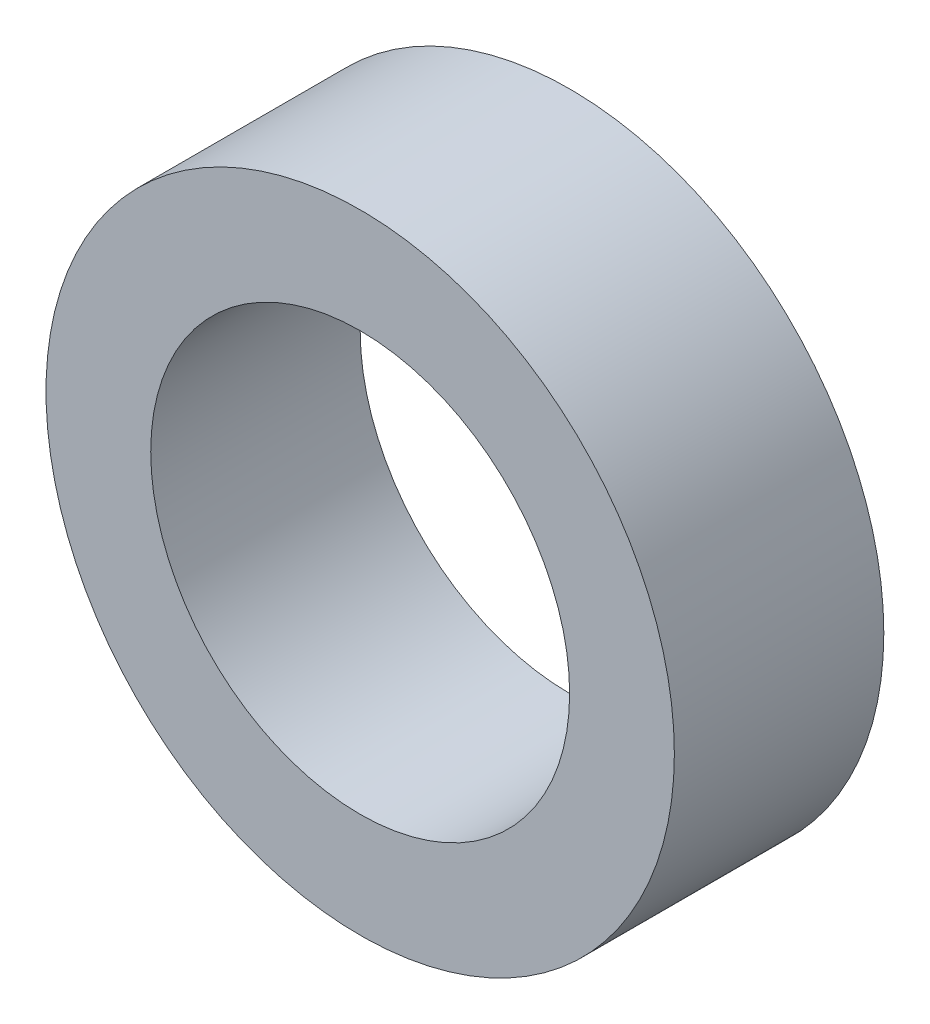
ISO-10303-21;
HEADER;
FILE_DESCRIPTION(('STEP AP214'),'2;1');
FILE_NAME('part.step','',(''),(''),'','','');
FILE_SCHEMA(('AUTOMOTIVE_DESIGN { 1 0 10303 214 1 1 1 1 }'));
ENDSEC;
DATA;
#1=APPLICATION_CONTEXT('core data for automotive mechanical design processes');
#2=APPLICATION_PROTOCOL_DEFINITION('international standard','automotive_design',2000,#1);
#3=PRODUCT_CONTEXT('',#1,'mechanical');
#4=PRODUCT('Part','Part','',(#3));
#5=PRODUCT_RELATED_PRODUCT_CATEGORY('part','',(#4));
#6=PRODUCT_DEFINITION_FORMATION('','',#4);
#7=PRODUCT_DEFINITION_CONTEXT('part definition',#1,'design');
#8=PRODUCT_DEFINITION('design','',#6,#7);
#9=PRODUCT_DEFINITION_SHAPE('','',#8);
#10=(LENGTH_UNIT() NAMED_UNIT(*) SI_UNIT(.MILLI.,.METRE.));
#11=(NAMED_UNIT(*) PLANE_ANGLE_UNIT() SI_UNIT($,.RADIAN.));
#12=(NAMED_UNIT(*) SI_UNIT($,.STERADIAN.) SOLID_ANGLE_UNIT());
#13=UNCERTAINTY_MEASURE_WITH_UNIT(LENGTH_MEASURE(1.E-05),#10,'distance_accuracy_value','');
#14=(GEOMETRIC_REPRESENTATION_CONTEXT(3) GLOBAL_UNCERTAINTY_ASSIGNED_CONTEXT((#13)) GLOBAL_UNIT_ASSIGNED_CONTEXT((#10,
#11,#12)) REPRESENTATION_CONTEXT('',''));
#15=CARTESIAN_POINT('',(0.,0.,0.));
#16=DIRECTION('',(0.,0.,1.));
#17=DIRECTION('',(1.,0.,0.));
#18=AXIS2_PLACEMENT_3D('',#15,#16,#17);
#19=CARTESIAN_POINT('',(0.,0.,4.));
#20=DIRECTION('',(0.,0.,1.));
#21=DIRECTION('',(1.,0.,0.));
#22=AXIS2_PLACEMENT_3D('',#19,#20,#21);
#23=PLANE('',#22);
#24=CARTESIAN_POINT('',(0.,0.,4.));
#25=DIRECTION('',(0.,0.,1.));
#26=DIRECTION('',(1.,0.,0.));
#27=AXIS2_PLACEMENT_3D('',#24,#25,#26);
#28=CIRCLE('',#27,6.);
#29=CARTESIAN_POINT('',(6.,0.,4.));
#30=VERTEX_POINT('',#29);
#31=EDGE_CURVE('E10',#30,#30,#28,.T.);
#32=ORIENTED_EDGE('',*,*,#31,.T.);
#33=EDGE_LOOP('',(#32));
#34=FACE_BOUND('',#33,.T.);
#35=CARTESIAN_POINT('',(0.,0.,4.));
#36=DIRECTION('',(0.,0.,1.));
#37=DIRECTION('',(1.,0.,0.));
#38=AXIS2_PLACEMENT_3D('',#35,#36,#37);
#39=CIRCLE('',#38,4.);
#40=CARTESIAN_POINT('',(4.,0.,4.));
#41=VERTEX_POINT('',#40);
#42=EDGE_CURVE('E42',#41,#41,#39,.T.);
#43=ORIENTED_EDGE('',*,*,#42,.F.);
#44=EDGE_LOOP('',(#43));
#45=FACE_BOUND('',#44,.T.);
#46=ADVANCED_FACE('F31',(#34,#45),#23,.T.);
#47=CARTESIAN_POINT('',(0.,0.,0.));
#48=DIRECTION('',(0.,0.,1.));
#49=DIRECTION('',(1.,0.,0.));
#50=AXIS2_PLACEMENT_3D('',#47,#48,#49);
#51=PLANE('',#50);
#52=CARTESIAN_POINT('',(0.,0.,0.));
#53=DIRECTION('',(0.,0.,1.));
#54=DIRECTION('',(1.,0.,0.));
#55=AXIS2_PLACEMENT_3D('',#52,#53,#54);
#56=CIRCLE('',#55,6.);
#57=CARTESIAN_POINT('',(6.,0.,0.));
#58=VERTEX_POINT('',#57);
#59=EDGE_CURVE('E35',#58,#58,#56,.T.);
#60=ORIENTED_EDGE('',*,*,#59,.F.);
#61=EDGE_LOOP('',(#60));
#62=FACE_BOUND('',#61,.T.);
#63=CARTESIAN_POINT('',(0.,0.,0.));
#64=DIRECTION('',(0.,0.,1.));
#65=DIRECTION('',(1.,0.,0.));
#66=AXIS2_PLACEMENT_3D('',#63,#64,#65);
#67=CIRCLE('',#66,4.);
#68=CARTESIAN_POINT('',(4.,0.,0.));
#69=VERTEX_POINT('',#68);
#70=EDGE_CURVE('E44',#69,#69,#67,.T.);
#71=ORIENTED_EDGE('',*,*,#70,.T.);
#72=EDGE_LOOP('',(#71));
#73=FACE_BOUND('',#72,.T.);
#74=ADVANCED_FACE('F54',(#62,#73),#51,.F.);
#75=CARTESIAN_POINT('',(0.,0.,4.));
#76=DIRECTION('',(0.,0.,-1.));
#77=DIRECTION('',(-1.,0.,0.));
#78=AXIS2_PLACEMENT_3D('',#75,#76,#77);
#79=CYLINDRICAL_SURFACE('',#78,6.);
#80=ORIENTED_EDGE('',*,*,#31,.F.);
#81=EDGE_LOOP('',(#80));
#82=FACE_BOUND('',#81,.T.);
#83=ORIENTED_EDGE('',*,*,#59,.T.);
#84=EDGE_LOOP('',(#83));
#85=FACE_BOUND('',#84,.T.);
#86=ADVANCED_FACE('F33',(#82,#85),#79,.T.);
#87=CARTESIAN_POINT('',(0.,0.,4.));
#88=DIRECTION('',(0.,0.,-1.));
#89=DIRECTION('',(-1.,0.,0.));
#90=AXIS2_PLACEMENT_3D('',#87,#88,#89);
#91=CYLINDRICAL_SURFACE('',#90,4.);
#92=ORIENTED_EDGE('',*,*,#42,.T.);
#93=EDGE_LOOP('',(#92));
#94=FACE_BOUND('',#93,.T.);
#95=ORIENTED_EDGE('',*,*,#70,.F.);
#96=EDGE_LOOP('',(#95));
#97=FACE_BOUND('',#96,.T.);
#98=ADVANCED_FACE('F50',(#94,#97),#91,.F.);
#99=CLOSED_SHELL('',(#46,#74,#86,#98));
#100=MANIFOLD_SOLID_BREP('B2',#99);
#101=ADVANCED_BREP_SHAPE_REPRESENTATION('',(#18,#100),#14);
#102=SHAPE_DEFINITION_REPRESENTATION(#9,#101);
ENDSEC;
END-ISO-10303-21;
